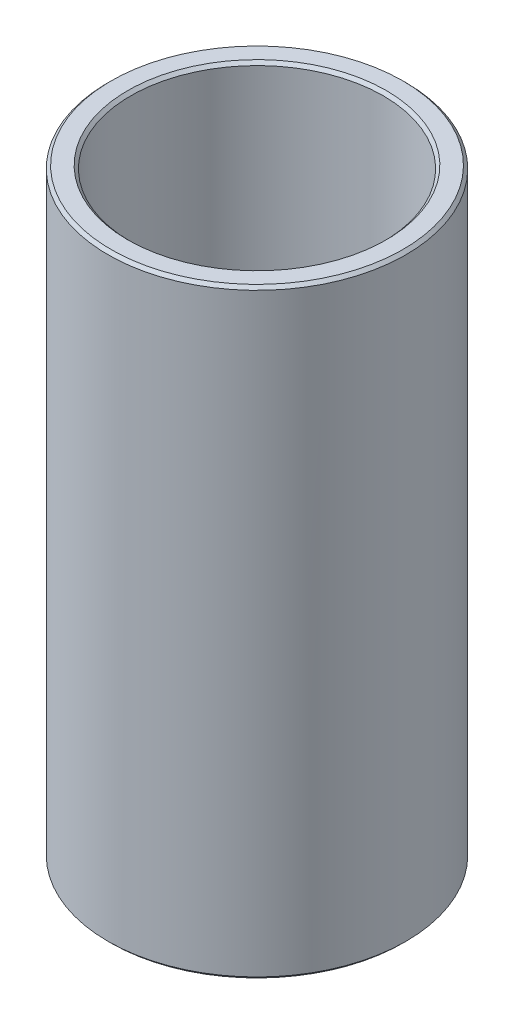
ISO-10303-21;
HEADER;
FILE_DESCRIPTION(('STEP AP214'),'2;1');
FILE_NAME('part.step','',(''),(''),'','','');
FILE_SCHEMA(('AUTOMOTIVE_DESIGN { 1 0 10303 214 1 1 1 1 }'));
ENDSEC;
DATA;
#1=APPLICATION_CONTEXT('core data for automotive mechanical design processes');
#2=APPLICATION_PROTOCOL_DEFINITION('international standard','automotive_design',2000,#1);
#3=PRODUCT_CONTEXT('',#1,'mechanical');
#4=PRODUCT('Part','Part','',(#3));
#5=PRODUCT_RELATED_PRODUCT_CATEGORY('part','',(#4));
#6=PRODUCT_DEFINITION_FORMATION('','',#4);
#7=PRODUCT_DEFINITION_CONTEXT('part definition',#1,'design');
#8=PRODUCT_DEFINITION('design','',#6,#7);
#9=PRODUCT_DEFINITION_SHAPE('','',#8);
#10=(LENGTH_UNIT() NAMED_UNIT(*) SI_UNIT(.MILLI.,.METRE.));
#11=(NAMED_UNIT(*) PLANE_ANGLE_UNIT() SI_UNIT($,.RADIAN.));
#12=(NAMED_UNIT(*) SI_UNIT($,.STERADIAN.) SOLID_ANGLE_UNIT());
#13=UNCERTAINTY_MEASURE_WITH_UNIT(LENGTH_MEASURE(1.E-05),#10,'distance_accuracy_value','');
#14=(GEOMETRIC_REPRESENTATION_CONTEXT(3) GLOBAL_UNCERTAINTY_ASSIGNED_CONTEXT((#13)) GLOBAL_UNIT_ASSIGNED_CONTEXT((#10,
#11,#12)) REPRESENTATION_CONTEXT('',''));
#15=CARTESIAN_POINT('',(0.,0.,0.));
#16=DIRECTION('',(0.,0.,1.));
#17=DIRECTION('',(1.,0.,0.));
#18=AXIS2_PLACEMENT_3D('',#15,#16,#17);
#19=CARTESIAN_POINT('',(0.,221.697302935374,0.));
#20=DIRECTION('',(0.,-1.,0.));
#21=DIRECTION('',(0.,0.,-1.));
#22=AXIS2_PLACEMENT_3D('',#19,#20,#21);
#23=CYLINDRICAL_SURFACE('',#22,55.);
#24=CARTESIAN_POINT('',(0.,1.11709429678408,0.));
#25=DIRECTION('',(0.,1.,0.));
#26=DIRECTION('',(0.,0.,1.));
#27=AXIS2_PLACEMENT_3D('',#24,#25,#26);
#28=CIRCLE('',#27,55.);
#29=CARTESIAN_POINT('',(0.,1.11709429678408,55.));
#30=VERTEX_POINT('',#29);
#31=EDGE_CURVE('E10',#30,#30,#28,.T.);
#32=ORIENTED_EDGE('',*,*,#31,.T.);
#33=EDGE_LOOP('',(#32));
#34=FACE_BOUND('',#33,.T.);
#35=CARTESIAN_POINT('',(0.,220.58020863859,0.));
#36=DIRECTION('',(0.,1.,0.));
#37=DIRECTION('',(0.,0.,1.));
#38=AXIS2_PLACEMENT_3D('',#35,#36,#37);
#39=CIRCLE('',#38,55.);
#40=CARTESIAN_POINT('',(0.,220.58020863859,-55.));
#41=VERTEX_POINT('',#40);
#42=EDGE_CURVE('E50',#41,#41,#39,.F.);
#43=ORIENTED_EDGE('',*,*,#42,.T.);
#44=EDGE_LOOP('',(#43));
#45=FACE_BOUND('',#44,.T.);
#46=ADVANCED_FACE('F39',(#34,#45),#23,.T.);
#47=CARTESIAN_POINT('',(0.,221.697302935374,0.));
#48=DIRECTION('',(0.,1.,0.));
#49=DIRECTION('',(0.,0.,1.));
#50=AXIS2_PLACEMENT_3D('',#47,#48,#49);
#51=PLANE('',#50);
#52=CARTESIAN_POINT('',(0.,221.697302935374,0.));
#53=DIRECTION('',(0.,1.,0.));
#54=DIRECTION('',(0.,0.,1.));
#55=AXIS2_PLACEMENT_3D('',#52,#53,#54);
#56=CIRCLE('',#55,47.7321395993003);
#57=CARTESIAN_POINT('',(0.,221.697302935374,47.7321395993003));
#58=VERTEX_POINT('',#57);
#59=EDGE_CURVE('E58',#58,#58,#56,.F.);
#60=ORIENTED_EDGE('',*,*,#59,.T.);
#61=EDGE_LOOP('',(#60));
#62=FACE_BOUND('',#61,.T.);
#63=CARTESIAN_POINT('',(0.,221.697302935374,0.));
#64=DIRECTION('',(0.,1.,0.));
#65=DIRECTION('',(0.,0.,1.));
#66=AXIS2_PLACEMENT_3D('',#63,#64,#65);
#67=CIRCLE('',#66,53.8829057032159);
#68=CARTESIAN_POINT('',(0.,221.697302935374,-53.8829057032159));
#69=VERTEX_POINT('',#68);
#70=EDGE_CURVE('E61',#69,#69,#67,.T.);
#71=ORIENTED_EDGE('',*,*,#70,.T.);
#72=EDGE_LOOP('',(#71));
#73=FACE_BOUND('',#72,.T.);
#74=ADVANCED_FACE('F88',(#62,#73),#51,.T.);
#75=CARTESIAN_POINT('',(0.,0.,0.));
#76=DIRECTION('',(0.,1.,0.));
#77=DIRECTION('',(0.,0.,1.));
#78=AXIS2_PLACEMENT_3D('',#75,#76,#77);
#79=PLANE('',#78);
#80=CARTESIAN_POINT('',(0.,0.,0.));
#81=DIRECTION('',(0.,1.,0.));
#82=DIRECTION('',(0.,0.,1.));
#83=AXIS2_PLACEMENT_3D('',#80,#81,#82);
#84=CIRCLE('',#83,47.7321395993002);
#85=CARTESIAN_POINT('',(0.,0.,47.7321395993002));
#86=VERTEX_POINT('',#85);
#87=EDGE_CURVE('E51',#86,#86,#84,.T.);
#88=ORIENTED_EDGE('',*,*,#87,.T.);
#89=EDGE_LOOP('',(#88));
#90=FACE_BOUND('',#89,.T.);
#91=CARTESIAN_POINT('',(0.,0.,0.));
#92=DIRECTION('',(0.,1.,0.));
#93=DIRECTION('',(0.,0.,1.));
#94=AXIS2_PLACEMENT_3D('',#91,#92,#93);
#95=CIRCLE('',#94,53.8829057032159);
#96=CARTESIAN_POINT('',(0.,0.,53.8829057032159));
#97=VERTEX_POINT('',#96);
#98=EDGE_CURVE('E54',#97,#97,#95,.F.);
#99=ORIENTED_EDGE('',*,*,#98,.T.);
#100=EDGE_LOOP('',(#99));
#101=FACE_BOUND('',#100,.T.);
#102=ADVANCED_FACE('F83',(#90,#101),#79,.F.);
#103=CARTESIAN_POINT('',(0.,221.697302935374,0.));
#104=DIRECTION('',(0.,-1.,0.));
#105=DIRECTION('',(0.,0.,-1.));
#106=AXIS2_PLACEMENT_3D('',#103,#104,#105);
#107=CYLINDRICAL_SURFACE('',#106,46.6150453025161);
#108=CARTESIAN_POINT('',(0.,220.58020863859,0.));
#109=DIRECTION('',(0.,1.,0.));
#110=DIRECTION('',(0.,0.,1.));
#111=AXIS2_PLACEMENT_3D('',#108,#109,#110);
#112=CIRCLE('',#111,46.6150453025161);
#113=CARTESIAN_POINT('',(0.,220.58020863859,46.6150453025161));
#114=VERTEX_POINT('',#113);
#115=EDGE_CURVE('E67',#114,#114,#112,.T.);
#116=ORIENTED_EDGE('',*,*,#115,.T.);
#117=EDGE_LOOP('',(#116));
#118=FACE_BOUND('',#117,.T.);
#119=CARTESIAN_POINT('',(0.,1.11709429678411,0.));
#120=DIRECTION('',(0.,1.,0.));
#121=DIRECTION('',(0.,0.,1.));
#122=AXIS2_PLACEMENT_3D('',#119,#120,#121);
#123=CIRCLE('',#122,46.6150453025161);
#124=CARTESIAN_POINT('',(0.,1.11709429678411,46.6150453025161));
#125=VERTEX_POINT('',#124);
#126=EDGE_CURVE('E69',#125,#125,#123,.F.);
#127=ORIENTED_EDGE('',*,*,#126,.T.);
#128=EDGE_LOOP('',(#127));
#129=FACE_BOUND('',#128,.T.);
#130=ADVANCED_FACE('F71',(#118,#129),#107,.F.);
#131=CARTESIAN_POINT('',(0.,220.58020863859,0.));
#132=DIRECTION('',(0.,1.,0.));
#133=DIRECTION('',(0.,0.,1.));
#134=AXIS2_PLACEMENT_3D('',#131,#132,#133);
#135=CONICAL_SURFACE('',#134,46.6150453025161,0.785398163397451);
#136=ORIENTED_EDGE('',*,*,#59,.F.);
#137=EDGE_LOOP('',(#136));
#138=FACE_BOUND('',#137,.T.);
#139=ORIENTED_EDGE('',*,*,#115,.F.);
#140=EDGE_LOOP('',(#139));
#141=FACE_BOUND('',#140,.T.);
#142=ADVANCED_FACE('F77',(#138,#141),#135,.F.);
#143=CARTESIAN_POINT('',(0.,0.,0.));
#144=DIRECTION('',(0.,-1.,0.));
#145=DIRECTION('',(0.,0.,-1.));
#146=AXIS2_PLACEMENT_3D('',#143,#144,#145);
#147=CONICAL_SURFACE('',#146,47.7321395993002,0.785398163397448);
#148=ORIENTED_EDGE('',*,*,#126,.F.);
#149=EDGE_LOOP('',(#148));
#150=FACE_BOUND('',#149,.T.);
#151=ORIENTED_EDGE('',*,*,#87,.F.);
#152=EDGE_LOOP('',(#151));
#153=FACE_BOUND('',#152,.T.);
#154=ADVANCED_FACE('F73',(#150,#153),#147,.F.);
#155=CARTESIAN_POINT('',(0.,1.11709429678408,0.));
#156=DIRECTION('',(0.,1.,0.));
#157=DIRECTION('',(0.,0.,1.));
#158=AXIS2_PLACEMENT_3D('',#155,#156,#157);
#159=CONICAL_SURFACE('',#158,55.,0.785398163397451);
#160=ORIENTED_EDGE('',*,*,#98,.F.);
#161=EDGE_LOOP('',(#160));
#162=FACE_BOUND('',#161,.T.);
#163=ORIENTED_EDGE('',*,*,#31,.F.);
#164=EDGE_LOOP('',(#163));
#165=FACE_BOUND('',#164,.T.);
#166=ADVANCED_FACE('F76',(#162,#165),#159,.T.);
#167=CARTESIAN_POINT('',(0.,221.697302935374,0.));
#168=DIRECTION('',(0.,-1.,0.));
#169=DIRECTION('',(0.,0.,-1.));
#170=AXIS2_PLACEMENT_3D('',#167,#168,#169);
#171=CONICAL_SURFACE('',#170,53.8829057032159,0.785398163397464);
#172=CARTESIAN_POINT('',(0.,220.58020863859,-55.));
#173=CARTESIAN_POINT('',(0.,220.591845037515,-54.9883636010752));
#174=CARTESIAN_POINT('',(0.,220.60348143644,-54.9767272021503));
#175=CARTESIAN_POINT('',(0.,220.62675423429,-54.9534544043007));
#176=CARTESIAN_POINT('',(0.,220.638390633214,-54.9418180053759));
#177=CARTESIAN_POINT('',(0.,220.661663431064,-54.9185452075262));
#178=CARTESIAN_POINT('',(0.,220.673299829989,-54.9069088086013));
#179=CARTESIAN_POINT('',(0.,220.696572627839,-54.8836360107517));
#180=CARTESIAN_POINT('',(0.,220.708209026763,-54.8719996118268));
#181=CARTESIAN_POINT('',(0.,220.731481824613,-54.8487268139772));
#182=CARTESIAN_POINT('',(0.,220.743118223538,-54.8370904150523));
#183=CARTESIAN_POINT('',(0.,220.766391021388,-54.8138176172027));
#184=CARTESIAN_POINT('',(0.,220.778027420312,-54.8021812182778));
#185=CARTESIAN_POINT('',(0.,220.801300218162,-54.7789084204282));
#186=CARTESIAN_POINT('',(0.,220.812936617087,-54.7672720215033));
#187=CARTESIAN_POINT('',(0.,220.836209414937,-54.7439992236537));
#188=CARTESIAN_POINT('',(0.,220.847845813861,-54.7323628247288));
#189=CARTESIAN_POINT('',(0.,220.871118611711,-54.7090900268792));
#190=CARTESIAN_POINT('',(0.,220.882755010636,-54.6974536279543));
#191=CARTESIAN_POINT('',(0.,220.906027808486,-54.6741808301047));
#192=CARTESIAN_POINT('',(0.,220.91766420741,-54.6625444311798));
#193=CARTESIAN_POINT('',(0.,220.94093700526,-54.6392716333301));
#194=CARTESIAN_POINT('',(0.,220.952573404185,-54.6276352344053));
#195=CARTESIAN_POINT('',(0.,220.975846202035,-54.6043624365556));
#196=CARTESIAN_POINT('',(0.,220.987482600959,-54.5927260376308));
#197=CARTESIAN_POINT('',(0.,221.010755398809,-54.5694532397811));
#198=CARTESIAN_POINT('',(0.,221.022391797734,-54.5578168408563));
#199=CARTESIAN_POINT('',(0.,221.045664595584,-54.5345440430066));
#200=CARTESIAN_POINT('',(0.,221.057300994508,-54.5229076440818));
#201=CARTESIAN_POINT('',(0.,221.080573792358,-54.4996348462321));
#202=CARTESIAN_POINT('',(0.,221.092210191283,-54.4879984473073));
#203=CARTESIAN_POINT('',(0.,221.115482989133,-54.4647256494576));
#204=CARTESIAN_POINT('',(0.,221.127119388057,-54.4530892505328));
#205=CARTESIAN_POINT('',(0.,221.150392185907,-54.4298164526831));
#206=CARTESIAN_POINT('',(0.,221.162028584832,-54.4181800537583));
#207=CARTESIAN_POINT('',(0.,221.185301382682,-54.3949072559086));
#208=CARTESIAN_POINT('',(0.,221.196937781607,-54.3832708569838));
#209=CARTESIAN_POINT('',(0.,221.220210579456,-54.3599980591341));
#210=CARTESIAN_POINT('',(0.,221.231846978381,-54.3483616602093));
#211=CARTESIAN_POINT('',(0.,221.255119776231,-54.3250888623596));
#212=CARTESIAN_POINT('',(0.,221.266756175156,-54.3134524634348));
#213=CARTESIAN_POINT('',(0.,221.290028973005,-54.2901796655851));
#214=CARTESIAN_POINT('',(0.,221.30166537193,-54.2785432666603));
#215=CARTESIAN_POINT('',(0.,221.32493816978,-54.2552704688106));
#216=CARTESIAN_POINT('',(0.,221.336574568705,-54.2436340698858));
#217=CARTESIAN_POINT('',(0.,221.359847366554,-54.2203612720361));
#218=CARTESIAN_POINT('',(0.,221.371483765479,-54.2087248731113));
#219=CARTESIAN_POINT('',(0.,221.394756563329,-54.1854520752616));
#220=CARTESIAN_POINT('',(0.,221.406392962254,-54.1738156763368));
#221=CARTESIAN_POINT('',(0.,221.429665760103,-54.1505428784871));
#222=CARTESIAN_POINT('',(0.,221.441302159028,-54.1389064795623));
#223=CARTESIAN_POINT('',(0.,221.464574956878,-54.1156336817126));
#224=CARTESIAN_POINT('',(0.,221.476211355802,-54.1039972827878));
#225=CARTESIAN_POINT('',(0.,221.499484153652,-54.0807244849381));
#226=CARTESIAN_POINT('',(0.,221.511120552577,-54.0690880860133));
#227=CARTESIAN_POINT('',(0.,221.534393350427,-54.0458152881636));
#228=CARTESIAN_POINT('',(0.,221.546029749352,-54.0341788892388));
#229=CARTESIAN_POINT('',(0.,221.569302547201,-54.0109060913891));
#230=CARTESIAN_POINT('',(0.,221.580938946126,-53.9992696924643));
#231=CARTESIAN_POINT('',(0.,221.604211743976,-53.9759968946146));
#232=CARTESIAN_POINT('',(0.,221.615848142901,-53.9643604956898));
#233=CARTESIAN_POINT('',(0.,221.63912094075,-53.9410876978401));
#234=CARTESIAN_POINT('',(0.,221.650757339675,-53.9294512989153));
#235=CARTESIAN_POINT('',(0.,221.674030137525,-53.9061785010656));
#236=CARTESIAN_POINT('',(0.,221.68566653645,-53.8945421021408));
#237=CARTESIAN_POINT('',(0.,221.697302935374,-53.8829057032159));
#238=B_SPLINE_CURVE_WITH_KNOTS('',3,(#172,#173,#174,#175,#176,#177,#178,#179,#180,#181,#182,
#183,#184,#185,#186,#187,#188,#189,#190,#191,#192,#193,#194,#195,#196,#197,#198,#199,#200,#201,
#202,#203,#204,#205,#206,#207,#208,#209,#210,#211,#212,#213,#214,#215,#216,#217,#218,#219,#220,
#221,#222,#223,#224,#225,#226,#227,#228,#229,#230,#231,#232,#233,#234,#235,#236,#237),
.UNSPECIFIED.,.F.,.F.,(4,2,2,2,2,2,2,2,2,2,2,2,2,2,2,2,2,2,2,2,2,2,2,2,2,2,2,2,2,2,2,2,4),(0.,
0.0493690595300428,0.0987381190601004,0.148107178590143,0.197476238120201,0.246845297650244,
0.296214357180301,0.345583416710364,0.394952476240402,0.444321535770464,0.493690595300502,
0.543059654830565,0.592428714360622,0.641797773890665,0.691166833420722,0.740535892950765,
0.789904952480828,0.839274012010885,0.888643071540928,0.938012131070986,0.987381190601029,
1.03675025013109,1.08611930966115,1.13548836919119,1.18485742872125,1.23422648825129,
1.28359554778135,1.33296460731141,1.38233366684145,1.43170272637151,1.48107178590155,
1.53044084543161,1.57980990496167),.UNSPECIFIED.);
#239=EDGE_CURVE('BSEAM45',#41,#69,#238,.T.);
#240=ORIENTED_EDGE('',*,*,#42,.F.);
#241=ORIENTED_EDGE('',*,*,#70,.F.);
#242=ORIENTED_EDGE('',*,*,#239,.T.);
#243=ORIENTED_EDGE('',*,*,#239,.F.);
#244=EDGE_LOOP('',(#240,#242,#241,#243));
#245=FACE_BOUND('',#244,.T.);
#246=ADVANCED_FACE('F45',(#245),#171,.T.);
#247=CLOSED_SHELL('',(#46,#74,#102,#130,#142,#154,#166,#246));
#248=MANIFOLD_SOLID_BREP('B2',#247);
#249=ADVANCED_BREP_SHAPE_REPRESENTATION('',(#18,#248),#14);
#250=SHAPE_DEFINITION_REPRESENTATION(#9,#249);
ENDSEC;
END-ISO-10303-21;
